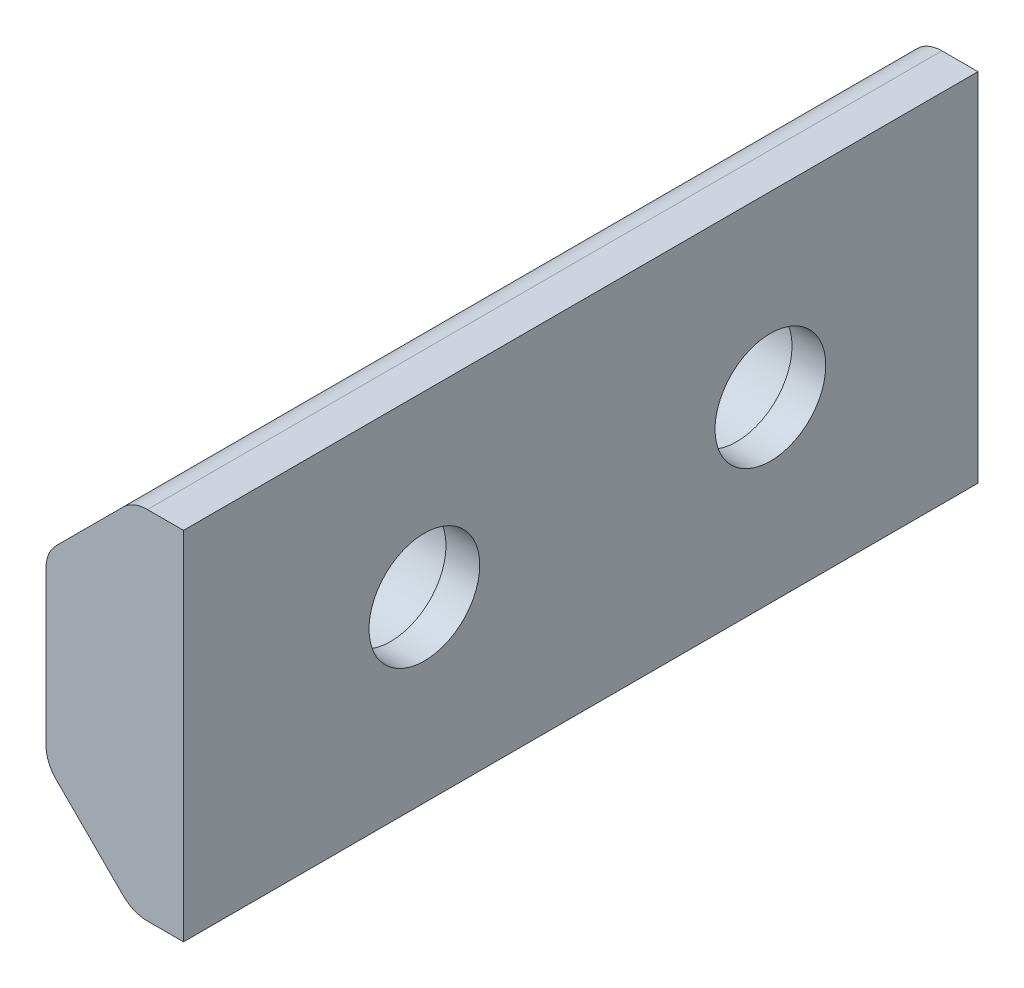
ISO-10303-21;
HEADER;
FILE_DESCRIPTION(('STEP AP214'),'2;1');
FILE_NAME('part.step','',(''),(''),'','','');
FILE_SCHEMA(('AUTOMOTIVE_DESIGN { 1 0 10303 214 1 1 1 1 }'));
ENDSEC;
DATA;
#1=APPLICATION_CONTEXT('core data for automotive mechanical design processes');
#2=APPLICATION_PROTOCOL_DEFINITION('international standard','automotive_design',2000,#1);
#3=PRODUCT_CONTEXT('',#1,'mechanical');
#4=PRODUCT('Part','Part','',(#3));
#5=PRODUCT_RELATED_PRODUCT_CATEGORY('part','',(#4));
#6=PRODUCT_DEFINITION_FORMATION('','',#4);
#7=PRODUCT_DEFINITION_CONTEXT('part definition',#1,'design');
#8=PRODUCT_DEFINITION('design','',#6,#7);
#9=PRODUCT_DEFINITION_SHAPE('','',#8);
#10=(LENGTH_UNIT() NAMED_UNIT(*) SI_UNIT(.MILLI.,.METRE.));
#11=(NAMED_UNIT(*) PLANE_ANGLE_UNIT() SI_UNIT($,.RADIAN.));
#12=(NAMED_UNIT(*) SI_UNIT($,.STERADIAN.) SOLID_ANGLE_UNIT());
#13=UNCERTAINTY_MEASURE_WITH_UNIT(LENGTH_MEASURE(1.E-05),#10,'distance_accuracy_value','');
#14=(GEOMETRIC_REPRESENTATION_CONTEXT(3) GLOBAL_UNCERTAINTY_ASSIGNED_CONTEXT((#13)) GLOBAL_UNIT_ASSIGNED_CONTEXT((#10,
#11,#12)) REPRESENTATION_CONTEXT('',''));
#15=CARTESIAN_POINT('',(0.,0.,0.));
#16=DIRECTION('',(0.,0.,1.));
#17=DIRECTION('',(1.,0.,0.));
#18=AXIS2_PLACEMENT_3D('',#15,#16,#17);
#19=CARTESIAN_POINT('',(-8.06619346294274,0.,6.));
#20=DIRECTION('',(1.,0.,0.));
#21=DIRECTION('',(0.,0.,-1.));
#22=AXIS2_PLACEMENT_3D('',#19,#20,#21);
#23=CYLINDRICAL_SURFACE('',#22,1.6);
#24=CARTESIAN_POINT('',(1.93380653705726,0.,6.));
#25=DIRECTION('',(1.,0.,0.));
#26=DIRECTION('',(0.,0.,-1.));
#27=AXIS2_PLACEMENT_3D('',#24,#25,#26);
#28=CIRCLE('',#27,1.6);
#29=CARTESIAN_POINT('',(1.93380653705726,0.,4.4));
#30=VERTEX_POINT('',#29);
#31=EDGE_CURVE('E144',#30,#30,#28,.T.);
#32=ORIENTED_EDGE('',*,*,#31,.T.);
#33=EDGE_LOOP('',(#32));
#34=FACE_BOUND('',#33,.T.);
#35=CARTESIAN_POINT('',(0.959641894022215,0.,6.));
#36=DIRECTION('',(-1.,0.,0.));
#37=DIRECTION('',(0.,0.,1.));
#38=AXIS2_PLACEMENT_3D('',#35,#36,#37);
#39=CIRCLE('',#38,1.6);
#40=CARTESIAN_POINT('',(0.959641894022215,0.,7.6));
#41=VERTEX_POINT('',#40);
#42=EDGE_CURVE('E141',#41,#41,#39,.F.);
#43=ORIENTED_EDGE('',*,*,#42,.F.);
#44=EDGE_LOOP('',(#43));
#45=FACE_BOUND('',#44,.T.);
#46=ADVANCED_FACE('F32',(#34,#45),#23,.F.);
#47=CARTESIAN_POINT('',(-8.06619346294274,0.,16.));
#48=DIRECTION('',(1.,0.,0.));
#49=DIRECTION('',(0.,0.,-1.));
#50=AXIS2_PLACEMENT_3D('',#47,#48,#49);
#51=CYLINDRICAL_SURFACE('',#50,1.6);
#52=CARTESIAN_POINT('',(1.93380653705726,0.,16.));
#53=DIRECTION('',(1.,0.,0.));
#54=DIRECTION('',(0.,0.,-1.));
#55=AXIS2_PLACEMENT_3D('',#52,#53,#54);
#56=CIRCLE('',#55,1.6);
#57=CARTESIAN_POINT('',(1.93380653705726,0.,14.4));
#58=VERTEX_POINT('',#57);
#59=EDGE_CURVE('E207',#58,#58,#56,.T.);
#60=ORIENTED_EDGE('',*,*,#59,.T.);
#61=EDGE_LOOP('',(#60));
#62=FACE_BOUND('',#61,.T.);
#63=CARTESIAN_POINT('',(0.959641894022215,0.,16.));
#64=DIRECTION('',(-1.,0.,0.));
#65=DIRECTION('',(0.,0.,1.));
#66=AXIS2_PLACEMENT_3D('',#63,#64,#65);
#67=CIRCLE('',#66,1.6);
#68=CARTESIAN_POINT('',(0.959641894022215,0.,17.6));
#69=VERTEX_POINT('',#68);
#70=EDGE_CURVE('E138',#69,#69,#67,.F.);
#71=ORIENTED_EDGE('',*,*,#70,.F.);
#72=EDGE_LOOP('',(#71));
#73=FACE_BOUND('',#72,.T.);
#74=ADVANCED_FACE('F253',(#62,#73),#51,.F.);
#75=CARTESIAN_POINT('',(0.476512404632426,5.15,36.));
#76=DIRECTION('',(0.,-1.,0.));
#77=DIRECTION('',(0.,0.,-1.));
#78=AXIS2_PLACEMENT_3D('',#75,#76,#77);
#79=PLANE('',#78);
#80=DIRECTION('',(0.,0.,-1.));
#81=VECTOR('',#80,1.);
#82=CARTESIAN_POINT('',(0.890725967005521,5.15,36.));
#83=LINE('',#82,#81);
#84=CARTESIAN_POINT('',(0.890725967005521,5.15,0.));
#85=VERTEX_POINT('',#84);
#86=CARTESIAN_POINT('',(0.890725967005521,5.15,22.9606274663145));
#87=VERTEX_POINT('',#86);
#88=EDGE_CURVE('E40',#85,#87,#83,.F.);
#89=ORIENTED_EDGE('',*,*,#88,.T.);
#90=DIRECTION('',(1.,0.,0.));
#91=VECTOR('',#90,1.);
#92=CARTESIAN_POINT('',(-8.06619346294274,5.15,22.9606274663145));
#93=LINE('',#92,#91);
#94=CARTESIAN_POINT('',(1.93380653705726,5.15,22.9606274663145));
#95=VERTEX_POINT('',#94);
#96=EDGE_CURVE('E46',#87,#95,#93,.T.);
#97=ORIENTED_EDGE('',*,*,#96,.T.);
#98=DIRECTION('',(0.,0.,-1.));
#99=VECTOR('',#98,1.);
#100=CARTESIAN_POINT('',(1.93380653705726,5.15,36.));
#101=LINE('',#100,#99);
#102=CARTESIAN_POINT('',(1.93380653705726,5.15,0.));
#103=VERTEX_POINT('',#102);
#104=EDGE_CURVE('E124',#95,#103,#101,.T.);
#105=ORIENTED_EDGE('',*,*,#104,.T.);
#106=DIRECTION('',(-1.,0.,0.));
#107=VECTOR('',#106,1.);
#108=CARTESIAN_POINT('',(0.476512404632426,5.15,0.));
#109=LINE('',#108,#107);
#110=EDGE_CURVE('E172',#103,#85,#109,.T.);
#111=ORIENTED_EDGE('',*,*,#110,.T.);
#112=EDGE_LOOP('',(#89,#97,#105,#111));
#113=FACE_BOUND('',#112,.T.);
#114=ADVANCED_FACE('F170',(#113),#79,.F.);
#115=CARTESIAN_POINT('',(-2.04035810597779,2.63312948938979,36.));
#116=DIRECTION('',(0.707106781186547,-0.707106781186547,0.));
#117=DIRECTION('',(0.707106781186548,0.707106781186548,0.));
#118=AXIS2_PLACEMENT_3D('',#115,#116,#117);
#119=PLANE('',#118);
#120=DIRECTION('',(0.,0.,-1.));
#121=VECTOR('',#120,1.);
#122=CARTESIAN_POINT('',(-1.74746488716433,2.92602270820324,36.));
#123=LINE('',#122,#121);
#124=CARTESIAN_POINT('',(-1.74746488716433,2.92602270820324,0.));
#125=VERTEX_POINT('',#124);
#126=CARTESIAN_POINT('',(-1.74746488716433,2.92602270820324,22.9606274663145));
#127=VERTEX_POINT('',#126);
#128=EDGE_CURVE('E164',#125,#127,#123,.F.);
#129=ORIENTED_EDGE('',*,*,#128,.T.);
#130=DIRECTION('',(0.707106781186548,0.707106781186548,0.));
#131=VECTOR('',#130,1.);
#132=CARTESIAN_POINT('',(-2.04035810597779,2.63312948938979,22.9606274663145));
#133=LINE('',#132,#131);
#134=CARTESIAN_POINT('',(0.183619185818973,4.85710678118655,22.9606274663145));
#135=VERTEX_POINT('',#134);
#136=EDGE_CURVE('E177',#127,#135,#133,.T.);
#137=ORIENTED_EDGE('',*,*,#136,.T.);
#138=DIRECTION('',(0.,0.,-1.));
#139=VECTOR('',#138,1.);
#140=CARTESIAN_POINT('',(0.183619185818973,4.85710678118655,36.));
#141=LINE('',#140,#139);
#142=CARTESIAN_POINT('',(0.183619185818973,4.85710678118655,0.));
#143=VERTEX_POINT('',#142);
#144=EDGE_CURVE('E162',#135,#143,#141,.T.);
#145=ORIENTED_EDGE('',*,*,#144,.T.);
#146=DIRECTION('',(-0.707106781186547,-0.707106781186547,0.));
#147=VECTOR('',#146,1.);
#148=CARTESIAN_POINT('',(-2.04035810597779,2.63312948938979,0.));
#149=LINE('',#148,#147);
#150=EDGE_CURVE('E213',#143,#125,#149,.T.);
#151=ORIENTED_EDGE('',*,*,#150,.T.);
#152=EDGE_LOOP('',(#129,#137,#145,#151));
#153=FACE_BOUND('',#152,.T.);
#154=ADVANCED_FACE('F180',(#153),#119,.F.);
#155=CARTESIAN_POINT('',(-2.04035810597779,-2.63312948938979,36.));
#156=DIRECTION('',(1.,0.,0.));
#157=DIRECTION('',(0.,0.,-1.));
#158=AXIS2_PLACEMENT_3D('',#155,#156,#157);
#159=PLANE('',#158);
#160=CARTESIAN_POINT('',(-2.04035810597779,0.,6.));
#161=DIRECTION('',(-1.,0.,0.));
#162=DIRECTION('',(0.,0.,1.));
#163=AXIS2_PLACEMENT_3D('',#160,#161,#162);
#164=CIRCLE('',#163,1.95);
#165=CARTESIAN_POINT('',(-2.04035810597779,0.,7.95));
#166=VERTEX_POINT('',#165);
#167=EDGE_CURVE('E196',#166,#166,#164,.T.);
#168=ORIENTED_EDGE('',*,*,#167,.F.);
#169=EDGE_LOOP('',(#168));
#170=FACE_BOUND('',#169,.T.);
#171=CARTESIAN_POINT('',(-2.04035810597779,0.,16.));
#172=DIRECTION('',(-1.,0.,0.));
#173=DIRECTION('',(0.,0.,1.));
#174=AXIS2_PLACEMENT_3D('',#171,#172,#173);
#175=CIRCLE('',#174,1.95);
#176=CARTESIAN_POINT('',(-2.04035810597779,0.,17.95));
#177=VERTEX_POINT('',#176);
#178=EDGE_CURVE('E200',#177,#177,#175,.T.);
#179=ORIENTED_EDGE('',*,*,#178,.F.);
#180=EDGE_LOOP('',(#179));
#181=FACE_BOUND('',#180,.T.);
#182=DIRECTION('',(0.,0.,-1.));
#183=VECTOR('',#182,1.);
#184=CARTESIAN_POINT('',(-2.04035810597779,-2.21891592701669,36.));
#185=LINE('',#184,#183);
#186=CARTESIAN_POINT('',(-2.04035810597779,-2.21891592701669,0.));
#187=VERTEX_POINT('',#186);
#188=CARTESIAN_POINT('',(-2.04035810597779,-2.21891592701669,22.9606274663145));
#189=VERTEX_POINT('',#188);
#190=EDGE_CURVE('E159',#187,#189,#185,.F.);
#191=ORIENTED_EDGE('',*,*,#190,.T.);
#192=DIRECTION('',(0.,1.,0.));
#193=VECTOR('',#192,1.);
#194=CARTESIAN_POINT('',(-2.04035810597779,-2.63312948938979,22.9606274663145));
#195=LINE('',#194,#193);
#196=CARTESIAN_POINT('',(-2.04035810597779,2.21891592701669,22.9606274663145));
#197=VERTEX_POINT('',#196);
#198=EDGE_CURVE('E184',#189,#197,#195,.T.);
#199=ORIENTED_EDGE('',*,*,#198,.T.);
#200=DIRECTION('',(0.,0.,-1.));
#201=VECTOR('',#200,1.);
#202=CARTESIAN_POINT('',(-2.04035810597779,2.21891592701669,36.));
#203=LINE('',#202,#201);
#204=CARTESIAN_POINT('',(-2.04035810597779,2.21891592701669,0.));
#205=VERTEX_POINT('',#204);
#206=EDGE_CURVE('E157',#197,#205,#203,.T.);
#207=ORIENTED_EDGE('',*,*,#206,.T.);
#208=DIRECTION('',(0.,-1.,0.));
#209=VECTOR('',#208,1.);
#210=CARTESIAN_POINT('',(-2.04035810597779,-2.63312948938979,0.));
#211=LINE('',#210,#209);
#212=EDGE_CURVE('E215',#205,#187,#211,.T.);
#213=ORIENTED_EDGE('',*,*,#212,.T.);
#214=EDGE_LOOP('',(#191,#199,#207,#213));
#215=FACE_BOUND('',#214,.T.);
#216=ADVANCED_FACE('F227',(#170,#181,#215),#159,.F.);
#217=CARTESIAN_POINT('',(0.476512404632426,-5.15,36.));
#218=DIRECTION('',(0.707106781186547,0.707106781186547,0.));
#219=DIRECTION('',(-0.707106781186548,0.707106781186548,0.));
#220=AXIS2_PLACEMENT_3D('',#217,#218,#219);
#221=PLANE('',#220);
#222=DIRECTION('',(0.,0.,-1.));
#223=VECTOR('',#222,1.);
#224=CARTESIAN_POINT('',(0.183619185818973,-4.85710678118655,36.));
#225=LINE('',#224,#223);
#226=CARTESIAN_POINT('',(0.183619185818973,-4.85710678118655,0.));
#227=VERTEX_POINT('',#226);
#228=CARTESIAN_POINT('',(0.183619185818973,-4.85710678118655,22.9606274663145));
#229=VERTEX_POINT('',#228);
#230=EDGE_CURVE('E154',#227,#229,#225,.F.);
#231=ORIENTED_EDGE('',*,*,#230,.T.);
#232=DIRECTION('',(-0.707106781186548,0.707106781186548,0.));
#233=VECTOR('',#232,1.);
#234=CARTESIAN_POINT('',(0.476512404632426,-5.15,22.9606274663145));
#235=LINE('',#234,#233);
#236=CARTESIAN_POINT('',(-1.74746488716433,-2.92602270820324,22.9606274663145));
#237=VERTEX_POINT('',#236);
#238=EDGE_CURVE('E192',#229,#237,#235,.T.);
#239=ORIENTED_EDGE('',*,*,#238,.T.);
#240=DIRECTION('',(0.,0.,-1.));
#241=VECTOR('',#240,1.);
#242=CARTESIAN_POINT('',(-1.74746488716433,-2.92602270820324,36.));
#243=LINE('',#242,#241);
#244=CARTESIAN_POINT('',(-1.74746488716433,-2.92602270820324,0.));
#245=VERTEX_POINT('',#244);
#246=EDGE_CURVE('E152',#237,#245,#243,.T.);
#247=ORIENTED_EDGE('',*,*,#246,.T.);
#248=DIRECTION('',(0.707106781186547,-0.707106781186547,0.));
#249=VECTOR('',#248,1.);
#250=CARTESIAN_POINT('',(0.476512404632426,-5.15,0.));
#251=LINE('',#250,#249);
#252=EDGE_CURVE('E218',#245,#227,#251,.T.);
#253=ORIENTED_EDGE('',*,*,#252,.T.);
#254=EDGE_LOOP('',(#231,#239,#247,#253));
#255=FACE_BOUND('',#254,.T.);
#256=ADVANCED_FACE('F235',(#255),#221,.F.);
#257=CARTESIAN_POINT('',(1.93380653705726,-5.15,36.));
#258=DIRECTION('',(0.,1.,0.));
#259=DIRECTION('',(0.,0.,1.));
#260=AXIS2_PLACEMENT_3D('',#257,#258,#259);
#261=PLANE('',#260);
#262=DIRECTION('',(0.,0.,-1.));
#263=VECTOR('',#262,1.);
#264=CARTESIAN_POINT('',(1.93380653705726,-5.15,36.));
#265=LINE('',#264,#263);
#266=CARTESIAN_POINT('',(1.93380653705726,-5.15,22.9606274663145));
#267=VERTEX_POINT('',#266);
#268=CARTESIAN_POINT('',(1.93380653705726,-5.15,0.));
#269=VERTEX_POINT('',#268);
#270=EDGE_CURVE('E122',#267,#269,#265,.T.);
#271=ORIENTED_EDGE('',*,*,#270,.F.);
#272=DIRECTION('',(1.,0.,0.));
#273=VECTOR('',#272,1.);
#274=CARTESIAN_POINT('',(-8.06619346294274,-5.15,22.9606274663145));
#275=LINE('',#274,#273);
#276=CARTESIAN_POINT('',(0.890725967005521,-5.15,22.9606274663145));
#277=VERTEX_POINT('',#276);
#278=EDGE_CURVE('E108',#277,#267,#275,.T.);
#279=ORIENTED_EDGE('',*,*,#278,.F.);
#280=DIRECTION('',(0.,0.,-1.));
#281=VECTOR('',#280,1.);
#282=CARTESIAN_POINT('',(0.890725967005521,-5.15,36.));
#283=LINE('',#282,#281);
#284=CARTESIAN_POINT('',(0.890725967005521,-5.15,0.));
#285=VERTEX_POINT('',#284);
#286=EDGE_CURVE('E130',#277,#285,#283,.T.);
#287=ORIENTED_EDGE('',*,*,#286,.T.);
#288=DIRECTION('',(1.,0.,0.));
#289=VECTOR('',#288,1.);
#290=CARTESIAN_POINT('',(1.93380653705726,-5.15,0.));
#291=LINE('',#290,#289);
#292=EDGE_CURVE('E128',#285,#269,#291,.T.);
#293=ORIENTED_EDGE('',*,*,#292,.T.);
#294=EDGE_LOOP('',(#271,#279,#287,#293));
#295=FACE_BOUND('',#294,.T.);
#296=ADVANCED_FACE('F126',(#295),#261,.F.);
#297=CARTESIAN_POINT('',(1.93380653705726,5.15,36.));
#298=DIRECTION('',(-1.,0.,0.));
#299=DIRECTION('',(0.,0.,1.));
#300=AXIS2_PLACEMENT_3D('',#297,#298,#299);
#301=PLANE('',#300);
#302=ORIENTED_EDGE('',*,*,#59,.F.);
#303=EDGE_LOOP('',(#302));
#304=FACE_BOUND('',#303,.T.);
#305=ORIENTED_EDGE('',*,*,#31,.F.);
#306=EDGE_LOOP('',(#305));
#307=FACE_BOUND('',#306,.T.);
#308=ORIENTED_EDGE('',*,*,#104,.F.);
#309=DIRECTION('',(0.,1.,0.));
#310=VECTOR('',#309,1.);
#311=CARTESIAN_POINT('',(1.93380653705726,5.15,22.9606274663145));
#312=LINE('',#311,#310);
#313=EDGE_CURVE('E111',#267,#95,#312,.T.);
#314=ORIENTED_EDGE('',*,*,#313,.F.);
#315=ORIENTED_EDGE('',*,*,#270,.T.);
#316=DIRECTION('',(0.,1.,0.));
#317=VECTOR('',#316,1.);
#318=CARTESIAN_POINT('',(1.93380653705726,5.15,0.));
#319=LINE('',#318,#317);
#320=EDGE_CURVE('E134',#269,#103,#319,.T.);
#321=ORIENTED_EDGE('',*,*,#320,.T.);
#322=EDGE_LOOP('',(#308,#314,#315,#321));
#323=FACE_BOUND('',#322,.T.);
#324=ADVANCED_FACE('F120',(#304,#307,#323),#301,.F.);
#325=CARTESIAN_POINT('',(0.,0.,0.));
#326=DIRECTION('',(0.,0.,-1.));
#327=DIRECTION('',(-1.,0.,0.));
#328=AXIS2_PLACEMENT_3D('',#325,#326,#327);
#329=PLANE('',#328);
#330=ORIENTED_EDGE('',*,*,#292,.F.);
#331=CARTESIAN_POINT('',(0.890725967005521,-4.15,0.));
#332=DIRECTION('',(0.,0.,-1.));
#333=DIRECTION('',(-1.,0.,0.));
#334=AXIS2_PLACEMENT_3D('',#331,#332,#333);
#335=CIRCLE('',#334,1.);
#336=EDGE_CURVE('E150',#285,#227,#335,.T.);
#337=ORIENTED_EDGE('',*,*,#336,.T.);
#338=ORIENTED_EDGE('',*,*,#252,.F.);
#339=CARTESIAN_POINT('',(-1.04035810597779,-2.21891592701669,0.));
#340=DIRECTION('',(0.,0.,-1.));
#341=DIRECTION('',(-1.,0.,0.));
#342=AXIS2_PLACEMENT_3D('',#339,#340,#341);
#343=CIRCLE('',#342,1.);
#344=EDGE_CURVE('E148',#245,#187,#343,.T.);
#345=ORIENTED_EDGE('',*,*,#344,.T.);
#346=ORIENTED_EDGE('',*,*,#212,.F.);
#347=CARTESIAN_POINT('',(-1.04035810597779,2.21891592701669,0.));
#348=DIRECTION('',(0.,0.,-1.));
#349=DIRECTION('',(-1.,0.,0.));
#350=AXIS2_PLACEMENT_3D('',#347,#348,#349);
#351=CIRCLE('',#350,1.);
#352=EDGE_CURVE('E54',#205,#125,#351,.T.);
#353=ORIENTED_EDGE('',*,*,#352,.T.);
#354=ORIENTED_EDGE('',*,*,#150,.F.);
#355=CARTESIAN_POINT('',(0.890725967005521,4.15,0.));
#356=DIRECTION('',(0.,0.,-1.));
#357=DIRECTION('',(-1.,0.,0.));
#358=AXIS2_PLACEMENT_3D('',#355,#356,#357);
#359=CIRCLE('',#358,1.);
#360=EDGE_CURVE('E132',#143,#85,#359,.T.);
#361=ORIENTED_EDGE('',*,*,#360,.T.);
#362=ORIENTED_EDGE('',*,*,#110,.F.);
#363=ORIENTED_EDGE('',*,*,#320,.F.);
#364=EDGE_LOOP('',(#330,#337,#338,#345,#346,#353,#354,#361,#362,#363));
#365=FACE_BOUND('',#364,.T.);
#366=ADVANCED_FACE('F221',(#365),#329,.T.);
#367=CARTESIAN_POINT('',(0.959641894022214,0.,16.));
#368=DIRECTION('',(-1.,0.,0.));
#369=DIRECTION('',(0.,0.,1.));
#370=AXIS2_PLACEMENT_3D('',#367,#368,#369);
#371=PLANE('',#370);
#372=CARTESIAN_POINT('',(0.959641894022214,0.,16.));
#373=DIRECTION('',(-1.,0.,0.));
#374=DIRECTION('',(0.,0.,1.));
#375=AXIS2_PLACEMENT_3D('',#372,#373,#374);
#376=CIRCLE('',#375,1.95);
#377=CARTESIAN_POINT('',(0.959641894022214,0.,17.95));
#378=VERTEX_POINT('',#377);
#379=EDGE_CURVE('E142',#378,#378,#376,.T.);
#380=ORIENTED_EDGE('',*,*,#379,.T.);
#381=EDGE_LOOP('',(#380));
#382=FACE_BOUND('',#381,.T.);
#383=ORIENTED_EDGE('',*,*,#70,.T.);
#384=EDGE_LOOP('',(#383));
#385=FACE_BOUND('',#384,.T.);
#386=ADVANCED_FACE('F266',(#382,#385),#371,.T.);
#387=CARTESIAN_POINT('',(0.959641894022214,0.,16.));
#388=DIRECTION('',(-1.,0.,0.));
#389=DIRECTION('',(0.,0.,1.));
#390=AXIS2_PLACEMENT_3D('',#387,#388,#389);
#391=CYLINDRICAL_SURFACE('',#390,1.95);
#392=ORIENTED_EDGE('',*,*,#379,.F.);
#393=EDGE_LOOP('',(#392));
#394=FACE_BOUND('',#393,.T.);
#395=ORIENTED_EDGE('',*,*,#178,.T.);
#396=EDGE_LOOP('',(#395));
#397=FACE_BOUND('',#396,.T.);
#398=ADVANCED_FACE('F314',(#394,#397),#391,.F.);
#399=CARTESIAN_POINT('',(0.959641894022214,0.,6.));
#400=DIRECTION('',(-1.,0.,0.));
#401=DIRECTION('',(0.,0.,1.));
#402=AXIS2_PLACEMENT_3D('',#399,#400,#401);
#403=PLANE('',#402);
#404=CARTESIAN_POINT('',(0.959641894022214,0.,6.));
#405=DIRECTION('',(-1.,0.,0.));
#406=DIRECTION('',(0.,0.,1.));
#407=AXIS2_PLACEMENT_3D('',#404,#405,#406);
#408=CIRCLE('',#407,1.95);
#409=CARTESIAN_POINT('',(0.959641894022214,0.,7.95));
#410=VERTEX_POINT('',#409);
#411=EDGE_CURVE('E197',#410,#410,#408,.T.);
#412=ORIENTED_EDGE('',*,*,#411,.T.);
#413=EDGE_LOOP('',(#412));
#414=FACE_BOUND('',#413,.T.);
#415=ORIENTED_EDGE('',*,*,#42,.T.);
#416=EDGE_LOOP('',(#415));
#417=FACE_BOUND('',#416,.T.);
#418=ADVANCED_FACE('F248',(#414,#417),#403,.T.);
#419=CARTESIAN_POINT('',(0.959641894022214,0.,6.));
#420=DIRECTION('',(-1.,0.,0.));
#421=DIRECTION('',(0.,0.,1.));
#422=AXIS2_PLACEMENT_3D('',#419,#420,#421);
#423=CYLINDRICAL_SURFACE('',#422,1.95);
#424=ORIENTED_EDGE('',*,*,#411,.F.);
#425=EDGE_LOOP('',(#424));
#426=FACE_BOUND('',#425,.T.);
#427=ORIENTED_EDGE('',*,*,#167,.T.);
#428=EDGE_LOOP('',(#427));
#429=FACE_BOUND('',#428,.T.);
#430=ADVANCED_FACE('F241',(#426,#429),#423,.F.);
#431=CARTESIAN_POINT('',(0.890725967005521,-4.15,36.));
#432=DIRECTION('',(0.,0.,-1.));
#433=DIRECTION('',(-1.,0.,0.));
#434=AXIS2_PLACEMENT_3D('',#431,#432,#433);
#435=CYLINDRICAL_SURFACE('',#434,1.);
#436=CARTESIAN_POINT('',(0.890725967005521,-4.15,22.9606274663145));
#437=DIRECTION('',(0.,0.,-1.));
#438=DIRECTION('',(-1.,0.,0.));
#439=AXIS2_PLACEMENT_3D('',#436,#437,#438);
#440=CIRCLE('',#439,1.);
#441=EDGE_CURVE('E113',#229,#277,#440,.F.);
#442=ORIENTED_EDGE('',*,*,#441,.F.);
#443=ORIENTED_EDGE('',*,*,#230,.F.);
#444=ORIENTED_EDGE('',*,*,#336,.F.);
#445=ORIENTED_EDGE('',*,*,#286,.F.);
#446=EDGE_LOOP('',(#442,#443,#444,#445));
#447=FACE_BOUND('',#446,.T.);
#448=ADVANCED_FACE('F239',(#447),#435,.T.);
#449=CARTESIAN_POINT('',(-1.04035810597779,-2.21891592701669,36.));
#450=DIRECTION('',(0.,0.,-1.));
#451=DIRECTION('',(-1.,0.,0.));
#452=AXIS2_PLACEMENT_3D('',#449,#450,#451);
#453=CYLINDRICAL_SURFACE('',#452,1.);
#454=CARTESIAN_POINT('',(-1.04035810597779,-2.21891592701669,22.9606274663145));
#455=DIRECTION('',(0.,0.,-1.));
#456=DIRECTION('',(-1.,0.,0.));
#457=AXIS2_PLACEMENT_3D('',#454,#455,#456);
#458=CIRCLE('',#457,1.);
#459=EDGE_CURVE('E190',#189,#237,#458,.F.);
#460=ORIENTED_EDGE('',*,*,#459,.F.);
#461=ORIENTED_EDGE('',*,*,#190,.F.);
#462=ORIENTED_EDGE('',*,*,#344,.F.);
#463=ORIENTED_EDGE('',*,*,#246,.F.);
#464=EDGE_LOOP('',(#460,#461,#462,#463));
#465=FACE_BOUND('',#464,.T.);
#466=ADVANCED_FACE('F231',(#465),#453,.T.);
#467=CARTESIAN_POINT('',(-1.04035810597779,2.21891592701669,36.));
#468=DIRECTION('',(0.,0.,-1.));
#469=DIRECTION('',(-1.,0.,0.));
#470=AXIS2_PLACEMENT_3D('',#467,#468,#469);
#471=CYLINDRICAL_SURFACE('',#470,1.);
#472=CARTESIAN_POINT('',(-1.04035810597779,2.21891592701669,22.9606274663145));
#473=DIRECTION('',(0.,0.,-1.));
#474=DIRECTION('',(-1.,0.,0.));
#475=AXIS2_PLACEMENT_3D('',#472,#473,#474);
#476=CIRCLE('',#475,1.);
#477=EDGE_CURVE('E182',#127,#197,#476,.F.);
#478=ORIENTED_EDGE('',*,*,#477,.F.);
#479=ORIENTED_EDGE('',*,*,#128,.F.);
#480=ORIENTED_EDGE('',*,*,#352,.F.);
#481=ORIENTED_EDGE('',*,*,#206,.F.);
#482=EDGE_LOOP('',(#478,#479,#480,#481));
#483=FACE_BOUND('',#482,.T.);
#484=ADVANCED_FACE('F223',(#483),#471,.T.);
#485=CARTESIAN_POINT('',(0.890725967005521,4.15,36.));
#486=DIRECTION('',(0.,0.,-1.));
#487=DIRECTION('',(-1.,0.,0.));
#488=AXIS2_PLACEMENT_3D('',#485,#486,#487);
#489=CYLINDRICAL_SURFACE('',#488,1.);
#490=CARTESIAN_POINT('',(0.890725967005521,4.15,22.9606274663145));
#491=DIRECTION('',(0.,0.,-1.));
#492=DIRECTION('',(-1.,0.,0.));
#493=AXIS2_PLACEMENT_3D('',#490,#491,#492);
#494=CIRCLE('',#493,1.);
#495=EDGE_CURVE('E11',#87,#135,#494,.F.);
#496=ORIENTED_EDGE('',*,*,#495,.F.);
#497=ORIENTED_EDGE('',*,*,#88,.F.);
#498=ORIENTED_EDGE('',*,*,#360,.F.);
#499=ORIENTED_EDGE('',*,*,#144,.F.);
#500=EDGE_LOOP('',(#496,#497,#498,#499));
#501=FACE_BOUND('',#500,.T.);
#502=ADVANCED_FACE('F34',(#501),#489,.T.);
#503=CARTESIAN_POINT('',(-8.06619346294274,5.15,22.9606274663145));
#504=DIRECTION('',(0.,0.,-1.));
#505=DIRECTION('',(-1.,0.,0.));
#506=AXIS2_PLACEMENT_3D('',#503,#504,#505);
#507=PLANE('',#506);
#508=ORIENTED_EDGE('',*,*,#441,.T.);
#509=ORIENTED_EDGE('',*,*,#278,.T.);
#510=ORIENTED_EDGE('',*,*,#313,.T.);
#511=ORIENTED_EDGE('',*,*,#96,.F.);
#512=ORIENTED_EDGE('',*,*,#495,.T.);
#513=ORIENTED_EDGE('',*,*,#136,.F.);
#514=ORIENTED_EDGE('',*,*,#477,.T.);
#515=ORIENTED_EDGE('',*,*,#198,.F.);
#516=ORIENTED_EDGE('',*,*,#459,.T.);
#517=ORIENTED_EDGE('',*,*,#238,.F.);
#518=EDGE_LOOP('',(#508,#509,#510,#511,#512,#513,#514,#515,#516,#517));
#519=FACE_BOUND('',#518,.T.);
#520=ADVANCED_FACE('F110',(#519),#507,.F.);
#521=CLOSED_SHELL('',(#46,#74,#114,#154,#216,#256,#296,#324,#366,#386,#398,#418,#430,#448,#466,
#484,#502,#520));
#522=MANIFOLD_SOLID_BREP('B2',#521);
#523=ADVANCED_BREP_SHAPE_REPRESENTATION('',(#18,#522),#14);
#524=SHAPE_DEFINITION_REPRESENTATION(#9,#523);
ENDSEC;
END-ISO-10303-21;
